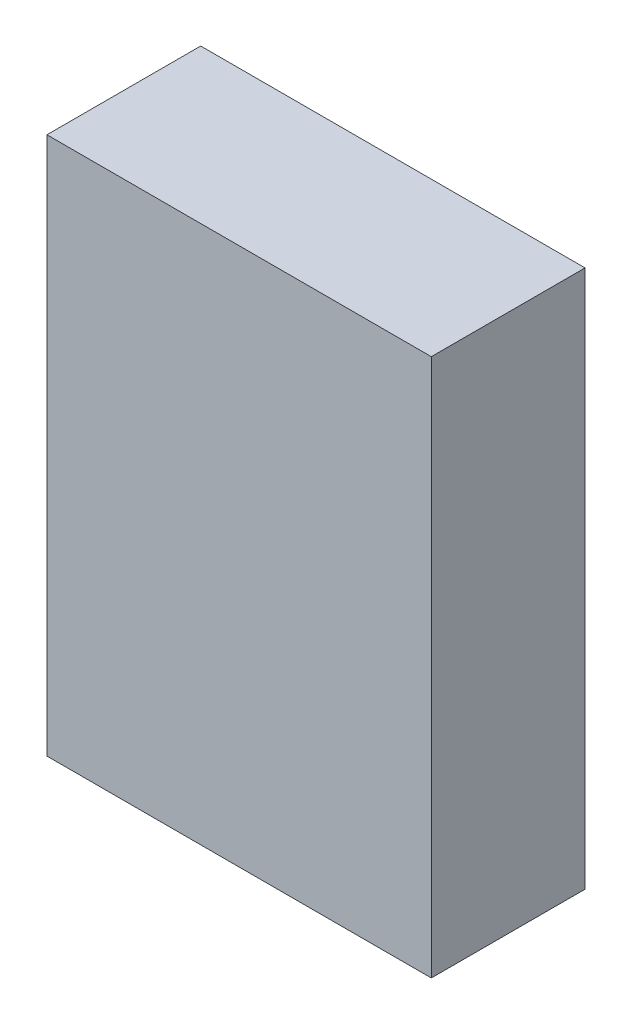
ISO-10303-21;
HEADER;
FILE_DESCRIPTION(('STEP AP214'),'2;1');
FILE_NAME('part.step','',(''),(''),'','','');
FILE_SCHEMA(('AUTOMOTIVE_DESIGN { 1 0 10303 214 1 1 1 1 }'));
ENDSEC;
DATA;
#1=APPLICATION_CONTEXT('core data for automotive mechanical design processes');
#2=APPLICATION_PROTOCOL_DEFINITION('international standard','automotive_design',2000,#1);
#3=PRODUCT_CONTEXT('',#1,'mechanical');
#4=PRODUCT('Part','Part','',(#3));
#5=PRODUCT_RELATED_PRODUCT_CATEGORY('part','',(#4));
#6=PRODUCT_DEFINITION_FORMATION('','',#4);
#7=PRODUCT_DEFINITION_CONTEXT('part definition',#1,'design');
#8=PRODUCT_DEFINITION('design','',#6,#7);
#9=PRODUCT_DEFINITION_SHAPE('','',#8);
#10=(LENGTH_UNIT() NAMED_UNIT(*) SI_UNIT(.MILLI.,.METRE.));
#11=(NAMED_UNIT(*) PLANE_ANGLE_UNIT() SI_UNIT($,.RADIAN.));
#12=(NAMED_UNIT(*) SI_UNIT($,.STERADIAN.) SOLID_ANGLE_UNIT());
#13=UNCERTAINTY_MEASURE_WITH_UNIT(LENGTH_MEASURE(1.E-05),#10,'distance_accuracy_value','');
#14=(GEOMETRIC_REPRESENTATION_CONTEXT(3) GLOBAL_UNCERTAINTY_ASSIGNED_CONTEXT((#13)) GLOBAL_UNIT_ASSIGNED_CONTEXT((#10,
#11,#12)) REPRESENTATION_CONTEXT('',''));
#15=CARTESIAN_POINT('',(0.,0.,0.));
#16=DIRECTION('',(0.,0.,1.));
#17=DIRECTION('',(1.,0.,0.));
#18=AXIS2_PLACEMENT_3D('',#15,#16,#17);
#19=CARTESIAN_POINT('',(-1.25000004,-1.74999904,1.00000054));
#20=DIRECTION('',(0.,0.,1.));
#21=DIRECTION('',(1.,0.,0.));
#22=AXIS2_PLACEMENT_3D('',#19,#20,#21);
#23=PLANE('',#22);
#24=DIRECTION('',(1.,0.,0.));
#25=VECTOR('',#24,1.);
#26=CARTESIAN_POINT('',(-1.25000004,1.74999904,1.00000054));
#27=LINE('',#26,#25);
#28=CARTESIAN_POINT('',(-1.25000004,1.74999904,1.00000054));
#29=VERTEX_POINT('',#28);
#30=CARTESIAN_POINT('',(1.25000004,1.74999904,1.00000054));
#31=VERTEX_POINT('',#30);
#32=EDGE_CURVE('E53',#29,#31,#27,.T.);
#33=ORIENTED_EDGE('',*,*,#32,.F.);
#34=DIRECTION('',(0.,1.,0.));
#35=VECTOR('',#34,1.);
#36=CARTESIAN_POINT('',(-1.25000004,-1.74999904,1.00000054));
#37=LINE('',#36,#35);
#38=CARTESIAN_POINT('',(-1.25000004,-1.74999904,1.00000054));
#39=VERTEX_POINT('',#38);
#40=EDGE_CURVE('E68',#39,#29,#37,.T.);
#41=ORIENTED_EDGE('',*,*,#40,.F.);
#42=DIRECTION('',(1.,0.,0.));
#43=VECTOR('',#42,1.);
#44=CARTESIAN_POINT('',(1.25000004,-1.74999904,1.00000054));
#45=LINE('',#44,#43);
#46=CARTESIAN_POINT('',(1.25000004,-1.74999904,1.00000054));
#47=VERTEX_POINT('',#46);
#48=EDGE_CURVE('E20',#47,#39,#45,.F.);
#49=ORIENTED_EDGE('',*,*,#48,.F.);
#50=DIRECTION('',(0.,1.,0.));
#51=VECTOR('',#50,1.);
#52=CARTESIAN_POINT('',(1.25000004,1.74999904,1.00000054));
#53=LINE('',#52,#51);
#54=EDGE_CURVE('E58',#31,#47,#53,.F.);
#55=ORIENTED_EDGE('',*,*,#54,.F.);
#56=EDGE_LOOP('',(#33,#41,#49,#55));
#57=FACE_BOUND('',#56,.T.);
#58=ADVANCED_FACE('F17',(#57),#23,.T.);
#59=CARTESIAN_POINT('',(1.25000004,-1.74999904,0.));
#60=DIRECTION('',(0.,-1.,0.));
#61=DIRECTION('',(0.,0.,-1.));
#62=AXIS2_PLACEMENT_3D('',#59,#60,#61);
#63=PLANE('',#62);
#64=DIRECTION('',(0.,0.,1.));
#65=VECTOR('',#64,1.);
#66=CARTESIAN_POINT('',(-1.25000004,-1.74999904,0.));
#67=LINE('',#66,#65);
#68=CARTESIAN_POINT('',(-1.25000004,-1.74999904,0.));
#69=VERTEX_POINT('',#68);
#70=EDGE_CURVE('E79',#69,#39,#67,.T.);
#71=ORIENTED_EDGE('',*,*,#70,.F.);
#72=DIRECTION('',(1.,0.,0.));
#73=VECTOR('',#72,1.);
#74=CARTESIAN_POINT('',(-1.25000004,-1.74999904,0.));
#75=LINE('',#74,#73);
#76=CARTESIAN_POINT('',(1.25000004,-1.74999904,0.));
#77=VERTEX_POINT('',#76);
#78=EDGE_CURVE('E74',#69,#77,#75,.T.);
#79=ORIENTED_EDGE('',*,*,#78,.T.);
#80=DIRECTION('',(0.,0.,-1.));
#81=VECTOR('',#80,1.);
#82=CARTESIAN_POINT('',(1.25000004,-1.74999904,0.));
#83=LINE('',#82,#81);
#84=EDGE_CURVE('E63',#47,#77,#83,.T.);
#85=ORIENTED_EDGE('',*,*,#84,.F.);
#86=ORIENTED_EDGE('',*,*,#48,.T.);
#87=EDGE_LOOP('',(#71,#79,#85,#86));
#88=FACE_BOUND('',#87,.T.);
#89=ADVANCED_FACE('F73',(#88),#63,.T.);
#90=CARTESIAN_POINT('',(1.25000004,1.74999904,0.));
#91=DIRECTION('',(1.,0.,0.));
#92=DIRECTION('',(0.,0.,-1.));
#93=AXIS2_PLACEMENT_3D('',#90,#91,#92);
#94=PLANE('',#93);
#95=ORIENTED_EDGE('',*,*,#84,.T.);
#96=DIRECTION('',(0.,1.,0.));
#97=VECTOR('',#96,1.);
#98=CARTESIAN_POINT('',(1.25000004,-1.74999904,0.));
#99=LINE('',#98,#97);
#100=CARTESIAN_POINT('',(1.25000004,1.74999904,0.));
#101=VERTEX_POINT('',#100);
#102=EDGE_CURVE('E84',#77,#101,#99,.T.);
#103=ORIENTED_EDGE('',*,*,#102,.T.);
#104=DIRECTION('',(0.,0.,1.));
#105=VECTOR('',#104,1.);
#106=CARTESIAN_POINT('',(1.25000004,1.74999904,0.));
#107=LINE('',#106,#105);
#108=EDGE_CURVE('E65',#31,#101,#107,.F.);
#109=ORIENTED_EDGE('',*,*,#108,.F.);
#110=ORIENTED_EDGE('',*,*,#54,.T.);
#111=EDGE_LOOP('',(#95,#103,#109,#110));
#112=FACE_BOUND('',#111,.T.);
#113=ADVANCED_FACE('F60',(#112),#94,.T.);
#114=CARTESIAN_POINT('',(-1.25000004,1.74999904,0.));
#115=DIRECTION('',(0.,1.,0.));
#116=DIRECTION('',(0.,0.,1.));
#117=AXIS2_PLACEMENT_3D('',#114,#115,#116);
#118=PLANE('',#117);
#119=ORIENTED_EDGE('',*,*,#108,.T.);
#120=DIRECTION('',(1.,0.,0.));
#121=VECTOR('',#120,1.);
#122=CARTESIAN_POINT('',(-1.25000004,1.74999904,0.));
#123=LINE('',#122,#121);
#124=CARTESIAN_POINT('',(-1.25000004,1.74999904,0.));
#125=VERTEX_POINT('',#124);
#126=EDGE_CURVE('E26',#101,#125,#123,.F.);
#127=ORIENTED_EDGE('',*,*,#126,.T.);
#128=DIRECTION('',(0.,0.,1.));
#129=VECTOR('',#128,1.);
#130=CARTESIAN_POINT('',(-1.25000004,1.74999904,0.));
#131=LINE('',#130,#129);
#132=EDGE_CURVE('E34',#29,#125,#131,.F.);
#133=ORIENTED_EDGE('',*,*,#132,.F.);
#134=ORIENTED_EDGE('',*,*,#32,.T.);
#135=EDGE_LOOP('',(#119,#127,#133,#134));
#136=FACE_BOUND('',#135,.T.);
#137=ADVANCED_FACE('F88',(#136),#118,.T.);
#138=CARTESIAN_POINT('',(-1.25000004,-1.74999904,0.));
#139=DIRECTION('',(-1.,0.,0.));
#140=DIRECTION('',(0.,0.,1.));
#141=AXIS2_PLACEMENT_3D('',#138,#139,#140);
#142=PLANE('',#141);
#143=ORIENTED_EDGE('',*,*,#132,.T.);
#144=DIRECTION('',(0.,1.,0.));
#145=VECTOR('',#144,1.);
#146=CARTESIAN_POINT('',(-1.25000004,-1.74999904,0.));
#147=LINE('',#146,#145);
#148=EDGE_CURVE('E11',#125,#69,#147,.F.);
#149=ORIENTED_EDGE('',*,*,#148,.T.);
#150=ORIENTED_EDGE('',*,*,#70,.T.);
#151=ORIENTED_EDGE('',*,*,#40,.T.);
#152=EDGE_LOOP('',(#143,#149,#150,#151));
#153=FACE_BOUND('',#152,.T.);
#154=ADVANCED_FACE('F91',(#153),#142,.T.);
#155=CARTESIAN_POINT('',(-1.25000004,-1.74999904,0.));
#156=DIRECTION('',(0.,0.,1.));
#157=DIRECTION('',(1.,0.,0.));
#158=AXIS2_PLACEMENT_3D('',#155,#156,#157);
#159=PLANE('',#158);
#160=ORIENTED_EDGE('',*,*,#126,.F.);
#161=ORIENTED_EDGE('',*,*,#102,.F.);
#162=ORIENTED_EDGE('',*,*,#78,.F.);
#163=ORIENTED_EDGE('',*,*,#148,.F.);
#164=EDGE_LOOP('',(#160,#161,#162,#163));
#165=FACE_BOUND('',#164,.T.);
#166=ADVANCED_FACE('F90',(#165),#159,.F.);
#167=CLOSED_SHELL('',(#58,#89,#113,#137,#154,#166));
#168=MANIFOLD_SOLID_BREP('B1',#167);
#169=ADVANCED_BREP_SHAPE_REPRESENTATION('',(#18,#168),#14);
#170=SHAPE_DEFINITION_REPRESENTATION(#9,#169);
ENDSEC;
END-ISO-10303-21;
